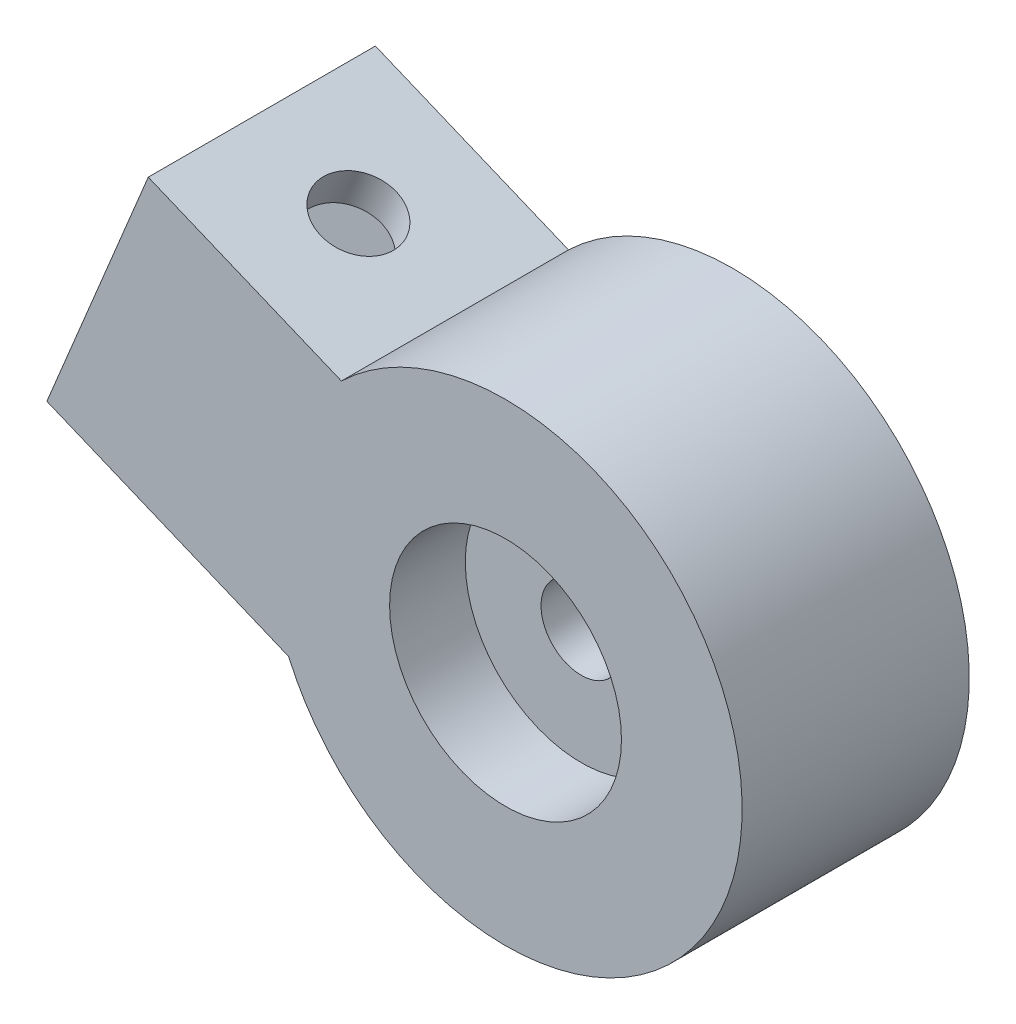
ISO-10303-21;
HEADER;
FILE_DESCRIPTION(('STEP AP214'),'2;1');
FILE_NAME('part.step','',(''),(''),'','','');
FILE_SCHEMA(('AUTOMOTIVE_DESIGN { 1 0 10303 214 1 1 1 1 }'));
ENDSEC;
DATA;
#1=APPLICATION_CONTEXT('core data for automotive mechanical design processes');
#2=APPLICATION_PROTOCOL_DEFINITION('international standard','automotive_design',2000,#1);
#3=PRODUCT_CONTEXT('',#1,'mechanical');
#4=PRODUCT('Part','Part','',(#3));
#5=PRODUCT_RELATED_PRODUCT_CATEGORY('part','',(#4));
#6=PRODUCT_DEFINITION_FORMATION('','',#4);
#7=PRODUCT_DEFINITION_CONTEXT('part definition',#1,'design');
#8=PRODUCT_DEFINITION('design','',#6,#7);
#9=PRODUCT_DEFINITION_SHAPE('','',#8);
#10=(LENGTH_UNIT() NAMED_UNIT(*) SI_UNIT(.MILLI.,.METRE.));
#11=(NAMED_UNIT(*) PLANE_ANGLE_UNIT() SI_UNIT($,.RADIAN.));
#12=(NAMED_UNIT(*) SI_UNIT($,.STERADIAN.) SOLID_ANGLE_UNIT());
#13=UNCERTAINTY_MEASURE_WITH_UNIT(LENGTH_MEASURE(1.E-05),#10,'distance_accuracy_value','');
#14=(GEOMETRIC_REPRESENTATION_CONTEXT(3) GLOBAL_UNCERTAINTY_ASSIGNED_CONTEXT((#13)) GLOBAL_UNIT_ASSIGNED_CONTEXT((#10,
#11,#12)) REPRESENTATION_CONTEXT('',''));
#15=CARTESIAN_POINT('',(0.,0.,0.));
#16=DIRECTION('',(0.,0.,1.));
#17=DIRECTION('',(1.,0.,0.));
#18=AXIS2_PLACEMENT_3D('',#15,#16,#17);
#19=CARTESIAN_POINT('',(0.,0.,12.));
#20=DIRECTION('',(0.,0.,-1.));
#21=DIRECTION('',(-1.,0.,0.));
#22=AXIS2_PLACEMENT_3D('',#19,#20,#21);
#23=CYLINDRICAL_SURFACE('',#22,12.5);
#24=DIRECTION('',(0.,0.,-1.));
#25=VECTOR('',#24,1.);
#26=CARTESIAN_POINT('',(-11.458506301557,-4.99526108798895,12.));
#27=LINE('',#26,#25);
#28=CARTESIAN_POINT('',(-11.4585063015571,-4.99526108798898,12.));
#29=VERTEX_POINT('',#28);
#30=CARTESIAN_POINT('',(-11.458506301557,-4.99526108798895,0.));
#31=VERTEX_POINT('',#30);
#32=EDGE_CURVE('E186',#29,#31,#27,.T.);
#33=ORIENTED_EDGE('',*,*,#32,.T.);
#34=CARTESIAN_POINT('',(0.,0.,0.));
#35=DIRECTION('',(0.,0.,1.));
#36=DIRECTION('',(1.,0.,0.));
#37=AXIS2_PLACEMENT_3D('',#34,#35,#36);
#38=CIRCLE('',#37,12.5);
#39=CARTESIAN_POINT('',(-8.67095256505801,9.00358715260279,0.));
#40=VERTEX_POINT('',#39);
#41=EDGE_CURVE('E47',#31,#40,#38,.T.);
#42=ORIENTED_EDGE('',*,*,#41,.T.);
#43=DIRECTION('',(0.,0.,-1.));
#44=VECTOR('',#43,1.);
#45=CARTESIAN_POINT('',(-8.67095256505799,9.00358715260276,12.));
#46=LINE('',#45,#44);
#47=CARTESIAN_POINT('',(-8.67095256505801,9.00358715260279,12.));
#48=VERTEX_POINT('',#47);
#49=EDGE_CURVE('E182',#48,#40,#46,.T.);
#50=ORIENTED_EDGE('',*,*,#49,.F.);
#51=CARTESIAN_POINT('',(0.,0.,12.));
#52=DIRECTION('',(0.,0.,1.));
#53=DIRECTION('',(1.,0.,0.));
#54=AXIS2_PLACEMENT_3D('',#51,#52,#53);
#55=CIRCLE('',#54,12.5);
#56=EDGE_CURVE('E11',#29,#48,#55,.T.);
#57=ORIENTED_EDGE('',*,*,#56,.F.);
#58=EDGE_LOOP('',(#33,#42,#50,#57));
#59=FACE_BOUND('',#58,.T.);
#60=ADVANCED_FACE('F38',(#59),#23,.T.);
#61=CARTESIAN_POINT('',(0.,0.,12.));
#62=DIRECTION('',(0.,0.,1.));
#63=DIRECTION('',(1.,0.,0.));
#64=AXIS2_PLACEMENT_3D('',#61,#62,#63);
#65=PLANE('',#64);
#66=CARTESIAN_POINT('',(0.,0.,12.));
#67=DIRECTION('',(0.,0.,1.));
#68=DIRECTION('',(1.,0.,0.));
#69=AXIS2_PLACEMENT_3D('',#66,#67,#68);
#70=CIRCLE('',#69,6.125);
#71=CARTESIAN_POINT('',(6.125,0.,12.));
#72=VERTEX_POINT('',#71);
#73=EDGE_CURVE('E234',#72,#72,#70,.T.);
#74=ORIENTED_EDGE('',*,*,#73,.F.);
#75=EDGE_LOOP('',(#74));
#76=FACE_BOUND('',#75,.T.);
#77=ORIENTED_EDGE('',*,*,#56,.T.);
#78=DIRECTION('',(-0.923879532511287,0.382683432365091,0.));
#79=VECTOR('',#78,1.);
#80=CARTESIAN_POINT('',(-18.8738723196785,13.229774890771,12.));
#81=LINE('',#80,#79);
#82=CARTESIAN_POINT('',(-18.8738723196785,13.229774890771,12.));
#83=VERTEX_POINT('',#82);
#84=EDGE_CURVE('E166',#48,#83,#81,.T.);
#85=ORIENTED_EDGE('',*,*,#84,.T.);
#86=DIRECTION('',(-0.382683432365091,-0.923879532511286,0.));
#87=VECTOR('',#86,1.);
#88=CARTESIAN_POINT('',(-20.7872894815039,8.61037722821454,12.));
#89=LINE('',#88,#87);
#90=CARTESIAN_POINT('',(-24.2314403727898,0.295461435612961,12.));
#91=VERTEX_POINT('',#90);
#92=EDGE_CURVE('E158',#83,#91,#89,.T.);
#93=ORIENTED_EDGE('',*,*,#92,.T.);
#94=DIRECTION('',(0.923879532511289,-0.382683432365084,0.));
#95=VECTOR('',#94,1.);
#96=CARTESIAN_POINT('',(-24.2314403727898,0.295461435612961,12.));
#97=LINE('',#96,#95);
#98=EDGE_CURVE('E162',#91,#29,#97,.T.);
#99=ORIENTED_EDGE('',*,*,#98,.T.);
#100=EDGE_LOOP('',(#77,#85,#93,#99));
#101=FACE_BOUND('',#100,.T.);
#102=ADVANCED_FACE('F207',(#76,#101),#65,.T.);
#103=CARTESIAN_POINT('',(0.,0.,0.));
#104=DIRECTION('',(0.,0.,1.));
#105=DIRECTION('',(1.,0.,0.));
#106=AXIS2_PLACEMENT_3D('',#103,#104,#105);
#107=PLANE('',#106);
#108=CARTESIAN_POINT('',(0.,0.,0.));
#109=DIRECTION('',(0.,0.,1.));
#110=DIRECTION('',(1.,0.,0.));
#111=AXIS2_PLACEMENT_3D('',#108,#109,#110);
#112=CIRCLE('',#111,2.125);
#113=CARTESIAN_POINT('',(2.125,0.,0.));
#114=VERTEX_POINT('',#113);
#115=EDGE_CURVE('E238',#114,#114,#112,.T.);
#116=ORIENTED_EDGE('',*,*,#115,.T.);
#117=EDGE_LOOP('',(#116));
#118=FACE_BOUND('',#117,.T.);
#119=ORIENTED_EDGE('',*,*,#41,.F.);
#120=DIRECTION('',(0.923879532511289,-0.382683432365084,0.));
#121=VECTOR('',#120,1.);
#122=CARTESIAN_POINT('',(-24.2314403727898,0.295461435612961,0.));
#123=LINE('',#122,#121);
#124=CARTESIAN_POINT('',(-24.2314403727898,0.295461435612961,0.));
#125=VERTEX_POINT('',#124);
#126=EDGE_CURVE('E152',#125,#31,#123,.T.);
#127=ORIENTED_EDGE('',*,*,#126,.F.);
#128=DIRECTION('',(-0.38268343236509,-0.923879532511286,0.));
#129=VECTOR('',#128,1.);
#130=CARTESIAN_POINT('',(-20.7872894815039,8.61037722821454,0.));
#131=LINE('',#130,#129);
#132=CARTESIAN_POINT('',(-18.8738723196785,13.229774890771,0.));
#133=VERTEX_POINT('',#132);
#134=EDGE_CURVE('E163',#133,#125,#131,.T.);
#135=ORIENTED_EDGE('',*,*,#134,.F.);
#136=DIRECTION('',(-0.923879532511287,0.382683432365091,0.));
#137=VECTOR('',#136,1.);
#138=CARTESIAN_POINT('',(-18.8738723196785,13.229774890771,0.));
#139=LINE('',#138,#137);
#140=EDGE_CURVE('E174',#40,#133,#139,.T.);
#141=ORIENTED_EDGE('',*,*,#140,.F.);
#142=EDGE_LOOP('',(#119,#127,#135,#141));
#143=FACE_BOUND('',#142,.T.);
#144=ADVANCED_FACE('F202',(#118,#143),#107,.F.);
#145=CARTESIAN_POINT('',(-24.2314403727898,0.295461435612961,12.));
#146=DIRECTION('',(0.382683432365084,0.923879532511289,0.));
#147=DIRECTION('',(-0.923879532511289,0.382683432365084,0.));
#148=AXIS2_PLACEMENT_3D('',#145,#146,#147);
#149=PLANE('',#148);
#150=CARTESIAN_POINT('',(-19.1299804954795,-1.8176324334711,6.));
#151=DIRECTION('',(0.382683432365084,0.923879532511289,0.));
#152=DIRECTION('',(-0.923879532511289,0.382683432365084,0.));
#153=AXIS2_PLACEMENT_3D('',#150,#151,#152);
#154=CIRCLE('',#153,2.);
#155=CARTESIAN_POINT('',(-20.9777395605021,-1.05226556874093,6.));
#156=VERTEX_POINT('',#155);
#157=EDGE_CURVE('E252',#156,#156,#154,.F.);
#158=ORIENTED_EDGE('',*,*,#157,.F.);
#159=EDGE_LOOP('',(#158));
#160=FACE_BOUND('',#159,.T.);
#161=ORIENTED_EDGE('',*,*,#126,.T.);
#162=ORIENTED_EDGE('',*,*,#32,.F.);
#163=ORIENTED_EDGE('',*,*,#98,.F.);
#164=DIRECTION('',(0.,0.,-1.));
#165=VECTOR('',#164,1.);
#166=CARTESIAN_POINT('',(-24.2314403727898,0.295461435612961,12.));
#167=LINE('',#166,#165);
#168=EDGE_CURVE('E189',#91,#125,#167,.T.);
#169=ORIENTED_EDGE('',*,*,#168,.T.);
#170=EDGE_LOOP('',(#161,#162,#163,#169));
#171=FACE_BOUND('',#170,.T.);
#172=ADVANCED_FACE('F209',(#160,#171),#149,.F.);
#173=CARTESIAN_POINT('',(-18.8738723196785,13.229774890771,12.));
#174=DIRECTION('',(-0.382683432365091,-0.923879532511286,0.));
#175=DIRECTION('',(0.923879532511287,-0.382683432365091,0.));
#176=AXIS2_PLACEMENT_3D('',#173,#174,#175);
#177=PLANE('',#176);
#178=CARTESIAN_POINT('',(-13.7724124423683,11.1166810216869,6.));
#179=DIRECTION('',(0.382683432365091,0.923879532511286,0.));
#180=DIRECTION('',(-0.923879532511286,0.382683432365091,0.));
#181=AXIS2_PLACEMENT_3D('',#178,#179,#180);
#182=CIRCLE('',#181,2.);
#183=CARTESIAN_POINT('',(-15.6201715073908,11.8820478864171,6.));
#184=VERTEX_POINT('',#183);
#185=EDGE_CURVE('E243',#184,#184,#182,.T.);
#186=ORIENTED_EDGE('',*,*,#185,.F.);
#187=EDGE_LOOP('',(#186));
#188=FACE_BOUND('',#187,.T.);
#189=ORIENTED_EDGE('',*,*,#140,.T.);
#190=DIRECTION('',(0.,0.,-1.));
#191=VECTOR('',#190,1.);
#192=CARTESIAN_POINT('',(-18.8738723196785,13.229774890771,12.));
#193=LINE('',#192,#191);
#194=EDGE_CURVE('E170',#83,#133,#193,.T.);
#195=ORIENTED_EDGE('',*,*,#194,.F.);
#196=ORIENTED_EDGE('',*,*,#84,.F.);
#197=ORIENTED_EDGE('',*,*,#49,.T.);
#198=EDGE_LOOP('',(#189,#195,#196,#197));
#199=FACE_BOUND('',#198,.T.);
#200=ADVANCED_FACE('F199',(#188,#199),#177,.F.);
#201=CARTESIAN_POINT('',(-20.7872894815039,8.61037722821454,12.));
#202=DIRECTION('',(0.923879532511287,-0.382683432365091,0.));
#203=DIRECTION('',(0.382683432365091,0.923879532511287,0.));
#204=AXIS2_PLACEMENT_3D('',#201,#202,#203);
#205=PLANE('',#204);
#206=DIRECTION('',(0.,0.,1.));
#207=VECTOR('',#206,1.);
#208=CARTESIAN_POINT('',(-23.4660735080596,2.14322050063554,2.));
#209=LINE('',#208,#207);
#210=CARTESIAN_POINT('',(-23.4660735080596,2.14322050063554,2.));
#211=VERTEX_POINT('',#210);
#212=CARTESIAN_POINT('',(-23.4660735080596,2.14322050063554,10.));
#213=VERTEX_POINT('',#212);
#214=EDGE_CURVE('E143',#211,#213,#209,.T.);
#215=ORIENTED_EDGE('',*,*,#214,.F.);
#216=DIRECTION('',(-0.382683432365091,-0.923879532511287,0.));
#217=VECTOR('',#216,1.);
#218=CARTESIAN_POINT('',(-19.6392391844087,11.3820158257484,2.));
#219=LINE('',#218,#217);
#220=CARTESIAN_POINT('',(-19.6392391844087,11.3820158257484,2.));
#221=VERTEX_POINT('',#220);
#222=EDGE_CURVE('E55',#221,#211,#219,.T.);
#223=ORIENTED_EDGE('',*,*,#222,.F.);
#224=DIRECTION('',(0.,0.,-1.));
#225=VECTOR('',#224,1.);
#226=CARTESIAN_POINT('',(-19.6392391844087,11.3820158257484,2.));
#227=LINE('',#226,#225);
#228=CARTESIAN_POINT('',(-19.6392391844087,11.3820158257484,10.));
#229=VERTEX_POINT('',#228);
#230=EDGE_CURVE('E127',#229,#221,#227,.T.);
#231=ORIENTED_EDGE('',*,*,#230,.F.);
#232=DIRECTION('',(0.382683432365091,0.923879532511287,0.));
#233=VECTOR('',#232,1.);
#234=CARTESIAN_POINT('',(-19.6392391844087,11.3820158257484,10.));
#235=LINE('',#234,#233);
#236=EDGE_CURVE('E131',#213,#229,#235,.T.);
#237=ORIENTED_EDGE('',*,*,#236,.F.);
#238=EDGE_LOOP('',(#215,#223,#231,#237));
#239=FACE_BOUND('',#238,.T.);
#240=ORIENTED_EDGE('',*,*,#134,.T.);
#241=ORIENTED_EDGE('',*,*,#168,.F.);
#242=ORIENTED_EDGE('',*,*,#92,.F.);
#243=ORIENTED_EDGE('',*,*,#194,.T.);
#244=EDGE_LOOP('',(#240,#241,#242,#243));
#245=FACE_BOUND('',#244,.T.);
#246=ADVANCED_FACE('F205',(#239,#245),#205,.F.);
#247=CARTESIAN_POINT('',(-10.4004438592958,7.5551815020975,2.));
#248=DIRECTION('',(0.,0.,-1.));
#249=DIRECTION('',(0.,1.,0.));
#250=AXIS2_PLACEMENT_3D('',#247,#248,#249);
#251=PLANE('',#250);
#252=ORIENTED_EDGE('',*,*,#222,.T.);
#253=DIRECTION('',(-0.923879532511287,0.382683432365091,0.));
#254=VECTOR('',#253,1.);
#255=CARTESIAN_POINT('',(-14.2272781829467,-1.68361382301537,2.));
#256=LINE('',#255,#254);
#257=CARTESIAN_POINT('',(-14.2272781829467,-1.68361382301537,2.));
#258=VERTEX_POINT('',#257);
#259=EDGE_CURVE('E102',#258,#211,#256,.T.);
#260=ORIENTED_EDGE('',*,*,#259,.F.);
#261=DIRECTION('',(-0.382683432365091,-0.923879532511287,0.));
#262=VECTOR('',#261,1.);
#263=CARTESIAN_POINT('',(-10.4004438592958,7.5551815020975,2.));
#264=LINE('',#263,#262);
#265=CARTESIAN_POINT('',(-10.4004438592958,7.5551815020975,2.));
#266=VERTEX_POINT('',#265);
#267=EDGE_CURVE('E106',#266,#258,#264,.T.);
#268=ORIENTED_EDGE('',*,*,#267,.F.);
#269=DIRECTION('',(-0.923879532511287,0.382683432365091,0.));
#270=VECTOR('',#269,1.);
#271=CARTESIAN_POINT('',(-10.4004438592958,7.5551815020975,2.));
#272=LINE('',#271,#270);
#273=EDGE_CURVE('E149',#266,#221,#272,.T.);
#274=ORIENTED_EDGE('',*,*,#273,.T.);
#275=EDGE_LOOP('',(#252,#260,#268,#274));
#276=FACE_BOUND('',#275,.T.);
#277=ADVANCED_FACE('F104',(#276),#251,.F.);
#278=CARTESIAN_POINT('',(-10.4004438592958,7.5551815020975,2.));
#279=DIRECTION('',(0.382683432365091,0.923879532511287,0.));
#280=DIRECTION('',(-0.923879532511287,0.382683432365091,0.));
#281=AXIS2_PLACEMENT_3D('',#278,#279,#280);
#282=PLANE('',#281);
#283=CARTESIAN_POINT('',(-14.5377793070984,9.26892195666431,6.));
#284=DIRECTION('',(0.382683432365091,0.923879532511287,0.));
#285=DIRECTION('',(-0.923879532511287,0.382683432365091,0.));
#286=AXIS2_PLACEMENT_3D('',#283,#284,#285);
#287=CIRCLE('',#286,2.);
#288=CARTESIAN_POINT('',(-16.385538372121,10.0342888213945,6.));
#289=VERTEX_POINT('',#288);
#290=EDGE_CURVE('E134',#289,#289,#287,.T.);
#291=ORIENTED_EDGE('',*,*,#290,.T.);
#292=EDGE_LOOP('',(#291));
#293=FACE_BOUND('',#292,.T.);
#294=ORIENTED_EDGE('',*,*,#230,.T.);
#295=ORIENTED_EDGE('',*,*,#273,.F.);
#296=DIRECTION('',(0.,0.,-1.));
#297=VECTOR('',#296,1.);
#298=CARTESIAN_POINT('',(-10.4004438592958,7.5551815020975,2.));
#299=LINE('',#298,#297);
#300=CARTESIAN_POINT('',(-10.4004438592958,7.5551815020975,10.));
#301=VERTEX_POINT('',#300);
#302=EDGE_CURVE('E113',#301,#266,#299,.T.);
#303=ORIENTED_EDGE('',*,*,#302,.F.);
#304=DIRECTION('',(-0.923879532511287,0.382683432365091,0.));
#305=VECTOR('',#304,1.);
#306=CARTESIAN_POINT('',(-10.4004438592958,7.5551815020975,10.));
#307=LINE('',#306,#305);
#308=EDGE_CURVE('E153',#301,#229,#307,.T.);
#309=ORIENTED_EDGE('',*,*,#308,.T.);
#310=EDGE_LOOP('',(#294,#295,#303,#309));
#311=FACE_BOUND('',#310,.T.);
#312=ADVANCED_FACE('F264',(#293,#311),#282,.F.);
#313=CARTESIAN_POINT('',(-10.4004438592958,7.5551815020975,10.));
#314=DIRECTION('',(0.,0.,1.));
#315=DIRECTION('',(0.,-1.,0.));
#316=AXIS2_PLACEMENT_3D('',#313,#314,#315);
#317=PLANE('',#316);
#318=ORIENTED_EDGE('',*,*,#236,.T.);
#319=ORIENTED_EDGE('',*,*,#308,.F.);
#320=DIRECTION('',(0.382683432365091,0.923879532511287,0.));
#321=VECTOR('',#320,1.);
#322=CARTESIAN_POINT('',(-10.4004438592958,7.5551815020975,10.));
#323=LINE('',#322,#321);
#324=CARTESIAN_POINT('',(-14.2272781829467,-1.68361382301537,10.));
#325=VERTEX_POINT('',#324);
#326=EDGE_CURVE('E122',#325,#301,#323,.T.);
#327=ORIENTED_EDGE('',*,*,#326,.F.);
#328=DIRECTION('',(-0.923879532511287,0.382683432365091,0.));
#329=VECTOR('',#328,1.);
#330=CARTESIAN_POINT('',(-14.2272781829467,-1.68361382301537,10.));
#331=LINE('',#330,#329);
#332=EDGE_CURVE('E112',#325,#213,#331,.T.);
#333=ORIENTED_EDGE('',*,*,#332,.T.);
#334=EDGE_LOOP('',(#318,#319,#327,#333));
#335=FACE_BOUND('',#334,.T.);
#336=ADVANCED_FACE('F285',(#335),#317,.F.);
#337=CARTESIAN_POINT('',(-14.2272781829467,-1.68361382301537,2.));
#338=DIRECTION('',(-0.382683432365091,-0.923879532511287,0.));
#339=DIRECTION('',(0.923879532511287,-0.382683432365091,0.));
#340=AXIS2_PLACEMENT_3D('',#337,#338,#339);
#341=PLANE('',#340);
#342=CARTESIAN_POINT('',(-18.3646136307493,0.0301266315514423,6.));
#343=DIRECTION('',(-0.382683432365091,-0.923879532511287,0.));
#344=DIRECTION('',(0.923879532511287,-0.382683432365091,0.));
#345=AXIS2_PLACEMENT_3D('',#342,#343,#344);
#346=CIRCLE('',#345,2.);
#347=CARTESIAN_POINT('',(-16.5168545657268,-0.735240233178739,6.));
#348=VERTEX_POINT('',#347);
#349=EDGE_CURVE('E41',#348,#348,#346,.T.);
#350=ORIENTED_EDGE('',*,*,#349,.T.);
#351=EDGE_LOOP('',(#350));
#352=FACE_BOUND('',#351,.T.);
#353=ORIENTED_EDGE('',*,*,#214,.T.);
#354=ORIENTED_EDGE('',*,*,#332,.F.);
#355=DIRECTION('',(0.,0.,1.));
#356=VECTOR('',#355,1.);
#357=CARTESIAN_POINT('',(-14.2272781829467,-1.68361382301537,2.));
#358=LINE('',#357,#356);
#359=EDGE_CURVE('E116',#258,#325,#358,.T.);
#360=ORIENTED_EDGE('',*,*,#359,.F.);
#361=ORIENTED_EDGE('',*,*,#259,.T.);
#362=EDGE_LOOP('',(#353,#354,#360,#361));
#363=FACE_BOUND('',#362,.T.);
#364=ADVANCED_FACE('F117',(#352,#363),#341,.F.);
#365=CARTESIAN_POINT('',(-11.5484941563911,4.78354290456364,0.));
#366=DIRECTION('',(-0.923879532511287,0.382683432365091,0.));
#367=DIRECTION('',(-0.382683432365091,-0.923879532511287,0.));
#368=AXIS2_PLACEMENT_3D('',#365,#366,#367);
#369=PLANE('',#368);
#370=ORIENTED_EDGE('',*,*,#267,.T.);
#371=ORIENTED_EDGE('',*,*,#359,.T.);
#372=ORIENTED_EDGE('',*,*,#326,.T.);
#373=ORIENTED_EDGE('',*,*,#302,.T.);
#374=EDGE_LOOP('',(#370,#371,#372,#373));
#375=FACE_BOUND('',#374,.T.);
#376=ADVANCED_FACE('F124',(#375),#369,.T.);
#377=CARTESIAN_POINT('',(-21.2947648960643,-7.0438842929766,6.));
#378=DIRECTION('',(0.382683432365091,0.923879532511286,0.));
#379=DIRECTION('',(-0.923879532511286,0.382683432365091,0.));
#380=AXIS2_PLACEMENT_3D('',#377,#378,#379);
#381=CYLINDRICAL_SURFACE('',#380,2.);
#382=ORIENTED_EDGE('',*,*,#157,.T.);
#383=EDGE_LOOP('',(#382));
#384=FACE_BOUND('',#383,.T.);
#385=ORIENTED_EDGE('',*,*,#349,.F.);
#386=EDGE_LOOP('',(#385));
#387=FACE_BOUND('',#386,.T.);
#388=ADVANCED_FACE('F270',(#384,#387),#381,.F.);
#389=ORIENTED_EDGE('',*,*,#185,.T.);
#390=EDGE_LOOP('',(#389));
#391=FACE_BOUND('',#390,.T.);
#392=ORIENTED_EDGE('',*,*,#290,.F.);
#393=EDGE_LOOP('',(#392));
#394=FACE_BOUND('',#393,.T.);
#395=ADVANCED_FACE('F267',(#391,#394),#381,.F.);
#396=CARTESIAN_POINT('',(0.,0.,8.));
#397=DIRECTION('',(0.,0.,1.));
#398=DIRECTION('',(1.,0.,0.));
#399=AXIS2_PLACEMENT_3D('',#396,#397,#398);
#400=CYLINDRICAL_SURFACE('',#399,6.125);
#401=CARTESIAN_POINT('',(0.,0.,8.));
#402=DIRECTION('',(0.,0.,1.));
#403=DIRECTION('',(1.,0.,0.));
#404=AXIS2_PLACEMENT_3D('',#401,#402,#403);
#405=CIRCLE('',#404,6.125);
#406=CARTESIAN_POINT('',(6.125,0.,8.));
#407=VERTEX_POINT('',#406);
#408=EDGE_CURVE('E237',#407,#407,#405,.T.);
#409=ORIENTED_EDGE('',*,*,#408,.F.);
#410=EDGE_LOOP('',(#409));
#411=FACE_BOUND('',#410,.T.);
#412=ORIENTED_EDGE('',*,*,#73,.T.);
#413=EDGE_LOOP('',(#412));
#414=FACE_BOUND('',#413,.T.);
#415=ADVANCED_FACE('F269',(#411,#414),#400,.F.);
#416=CARTESIAN_POINT('',(0.,0.,8.));
#417=DIRECTION('',(0.,0.,1.));
#418=DIRECTION('',(1.,0.,0.));
#419=AXIS2_PLACEMENT_3D('',#416,#417,#418);
#420=PLANE('',#419);
#421=CARTESIAN_POINT('',(0.,0.,8.));
#422=DIRECTION('',(0.,0.,1.));
#423=DIRECTION('',(1.,0.,0.));
#424=AXIS2_PLACEMENT_3D('',#421,#422,#423);
#425=CIRCLE('',#424,2.125);
#426=CARTESIAN_POINT('',(2.125,0.,8.));
#427=VERTEX_POINT('',#426);
#428=EDGE_CURVE('E246',#427,#427,#425,.T.);
#429=ORIENTED_EDGE('',*,*,#428,.F.);
#430=EDGE_LOOP('',(#429));
#431=FACE_BOUND('',#430,.T.);
#432=ORIENTED_EDGE('',*,*,#408,.T.);
#433=EDGE_LOOP('',(#432));
#434=FACE_BOUND('',#433,.T.);
#435=ADVANCED_FACE('F276',(#431,#434),#420,.T.);
#436=CARTESIAN_POINT('',(0.,0.,0.));
#437=DIRECTION('',(0.,0.,1.));
#438=DIRECTION('',(1.,0.,0.));
#439=AXIS2_PLACEMENT_3D('',#436,#437,#438);
#440=CYLINDRICAL_SURFACE('',#439,2.125);
#441=ORIENTED_EDGE('',*,*,#115,.F.);
#442=EDGE_LOOP('',(#441));
#443=FACE_BOUND('',#442,.T.);
#444=ORIENTED_EDGE('',*,*,#428,.T.);
#445=EDGE_LOOP('',(#444));
#446=FACE_BOUND('',#445,.T.);
#447=ADVANCED_FACE('F347',(#443,#446),#440,.F.);
#448=CLOSED_SHELL('',(#60,#102,#144,#172,#200,#246,#277,#312,#336,#364,#376,#388,#395,#415,#435,#447));
#449=MANIFOLD_SOLID_BREP('B2',#448);
#450=ADVANCED_BREP_SHAPE_REPRESENTATION('',(#18,#449),#14);
#451=SHAPE_DEFINITION_REPRESENTATION(#9,#450);
ENDSEC;
END-ISO-10303-21;
